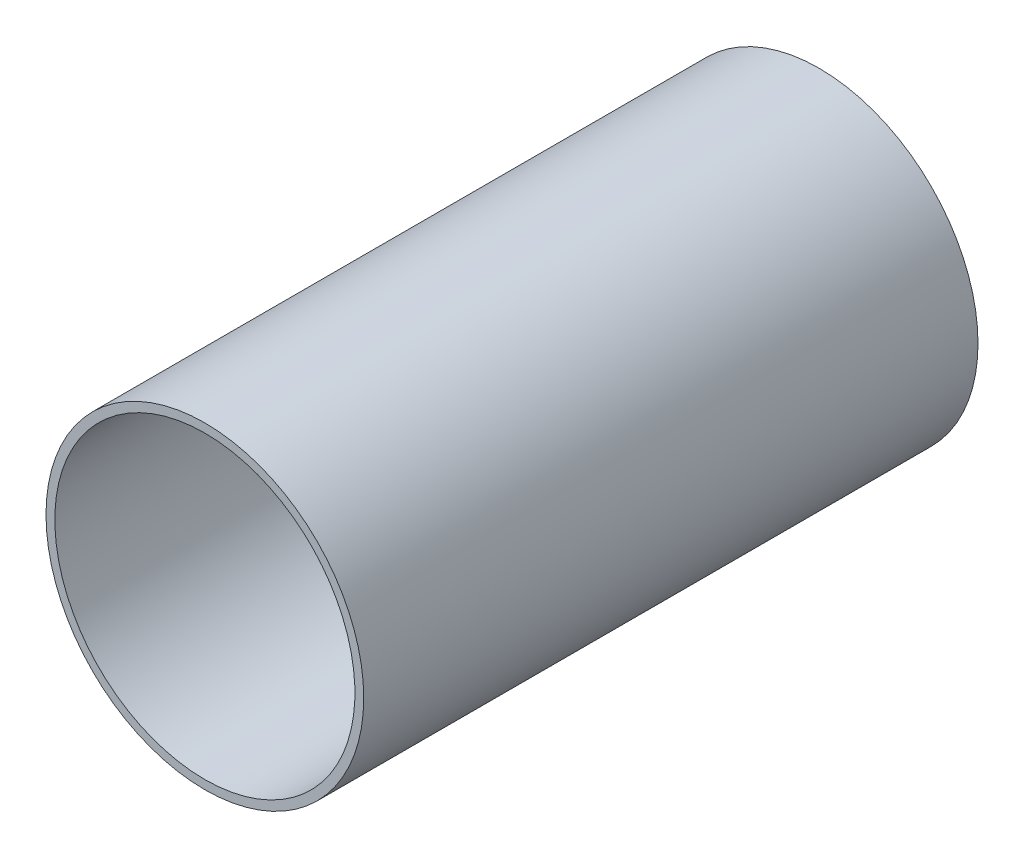
ISO-10303-21;
HEADER;
FILE_DESCRIPTION(('STEP AP214'),'2;1');
FILE_NAME('part.step','',(''),(''),'','','');
FILE_SCHEMA(('AUTOMOTIVE_DESIGN { 1 0 10303 214 1 1 1 1 }'));
ENDSEC;
DATA;
#1=APPLICATION_CONTEXT('core data for automotive mechanical design processes');
#2=APPLICATION_PROTOCOL_DEFINITION('international standard','automotive_design',2000,#1);
#3=PRODUCT_CONTEXT('',#1,'mechanical');
#4=PRODUCT('Part','Part','',(#3));
#5=PRODUCT_RELATED_PRODUCT_CATEGORY('part','',(#4));
#6=PRODUCT_DEFINITION_FORMATION('','',#4);
#7=PRODUCT_DEFINITION_CONTEXT('part definition',#1,'design');
#8=PRODUCT_DEFINITION('design','',#6,#7);
#9=PRODUCT_DEFINITION_SHAPE('','',#8);
#10=(LENGTH_UNIT() NAMED_UNIT(*) SI_UNIT(.MILLI.,.METRE.));
#11=(NAMED_UNIT(*) PLANE_ANGLE_UNIT() SI_UNIT($,.RADIAN.));
#12=(NAMED_UNIT(*) SI_UNIT($,.STERADIAN.) SOLID_ANGLE_UNIT());
#13=UNCERTAINTY_MEASURE_WITH_UNIT(LENGTH_MEASURE(1.E-05),#10,'distance_accuracy_value','');
#14=(GEOMETRIC_REPRESENTATION_CONTEXT(3) GLOBAL_UNCERTAINTY_ASSIGNED_CONTEXT((#13)) GLOBAL_UNIT_ASSIGNED_CONTEXT((#10,
#11,#12)) REPRESENTATION_CONTEXT('',''));
#15=CARTESIAN_POINT('',(0.,0.,0.));
#16=DIRECTION('',(0.,0.,1.));
#17=DIRECTION('',(1.,0.,0.));
#18=AXIS2_PLACEMENT_3D('',#15,#16,#17);
#19=CARTESIAN_POINT('',(169.418,-153.249,-0.045));
#20=DIRECTION('',(0.,0.,-1.));
#21=DIRECTION('',(0.,-1.,0.));
#22=AXIS2_PLACEMENT_3D('',#19,#20,#21);
#23=CYLINDRICAL_SURFACE('',#22,0.425);
#24=CARTESIAN_POINT('',(169.418,-153.249,-0.035));
#25=DIRECTION('',(0.,0.,-1.));
#26=DIRECTION('',(0.,-1.,0.));
#27=AXIS2_PLACEMENT_3D('',#24,#25,#26);
#28=CIRCLE('',#27,0.425);
#29=CARTESIAN_POINT('',(169.418,-153.674,-0.035));
#30=VERTEX_POINT('',#29);
#31=EDGE_CURVE('E63',#30,#30,#28,.T.);
#32=ORIENTED_EDGE('',*,*,#31,.T.);
#33=DIRECTION('',(0.,0.,1.));
#34=VECTOR('',#33,1.);
#35=CARTESIAN_POINT('',(169.418,-153.674,-0.045));
#36=LINE('',#35,#34);
#37=CARTESIAN_POINT('',(169.418,-153.674,1.705));
#38=VERTEX_POINT('',#37);
#39=EDGE_CURVE('E11',#30,#38,#36,.T.);
#40=ORIENTED_EDGE('',*,*,#39,.T.);
#41=CARTESIAN_POINT('',(169.418,-153.249,1.705));
#42=DIRECTION('',(0.,0.,-1.));
#43=DIRECTION('',(0.,-1.,0.));
#44=AXIS2_PLACEMENT_3D('',#41,#42,#43);
#45=CIRCLE('',#44,0.425);
#46=EDGE_CURVE('E25',#38,#38,#45,.T.);
#47=ORIENTED_EDGE('',*,*,#46,.F.);
#48=ORIENTED_EDGE('',*,*,#39,.F.);
#49=EDGE_LOOP('',(#32,#40,#47,#48));
#50=FACE_BOUND('',#49,.T.);
#51=ADVANCED_FACE('F17',(#50),#23,.F.);
#52=CARTESIAN_POINT('',(169.418,-153.699,1.705));
#53=DIRECTION('',(0.,0.,1.));
#54=DIRECTION('',(1.,0.,0.));
#55=AXIS2_PLACEMENT_3D('',#52,#53,#54);
#56=PLANE('',#55);
#57=ORIENTED_EDGE('',*,*,#46,.T.);
#58=EDGE_LOOP('',(#57));
#59=FACE_BOUND('',#58,.T.);
#60=CARTESIAN_POINT('',(169.418,-153.249,1.705));
#61=DIRECTION('',(0.,0.,1.));
#62=DIRECTION('',(0.,-1.,0.));
#63=AXIS2_PLACEMENT_3D('',#60,#61,#62);
#64=CIRCLE('',#63,0.45);
#65=CARTESIAN_POINT('',(169.418,-153.699,1.705));
#66=VERTEX_POINT('',#65);
#67=EDGE_CURVE('E55',#66,#66,#64,.T.);
#68=ORIENTED_EDGE('',*,*,#67,.T.);
#69=EDGE_LOOP('',(#68));
#70=FACE_BOUND('',#69,.T.);
#71=ADVANCED_FACE('F75',(#59,#70),#56,.T.);
#72=CARTESIAN_POINT('',(169.418,-153.699,-0.035));
#73=DIRECTION('',(0.,0.,1.));
#74=DIRECTION('',(1.,0.,0.));
#75=AXIS2_PLACEMENT_3D('',#72,#73,#74);
#76=PLANE('',#75);
#77=ORIENTED_EDGE('',*,*,#31,.F.);
#78=EDGE_LOOP('',(#77));
#79=FACE_BOUND('',#78,.T.);
#80=CARTESIAN_POINT('',(169.418,-153.249,-0.035));
#81=DIRECTION('',(0.,0.,1.));
#82=DIRECTION('',(0.,-1.,0.));
#83=AXIS2_PLACEMENT_3D('',#80,#81,#82);
#84=CIRCLE('',#83,0.45);
#85=CARTESIAN_POINT('',(169.418,-153.699,-0.035));
#86=VERTEX_POINT('',#85);
#87=EDGE_CURVE('E54',#86,#86,#84,.T.);
#88=ORIENTED_EDGE('',*,*,#87,.F.);
#89=EDGE_LOOP('',(#88));
#90=FACE_BOUND('',#89,.T.);
#91=ADVANCED_FACE('F83',(#79,#90),#76,.F.);
#92=CARTESIAN_POINT('',(169.418,-153.249,-0.035));
#93=DIRECTION('',(0.,0.,-1.));
#94=DIRECTION('',(0.,-1.,0.));
#95=AXIS2_PLACEMENT_3D('',#92,#93,#94);
#96=CYLINDRICAL_SURFACE('',#95,0.45);
#97=ORIENTED_EDGE('',*,*,#87,.T.);
#98=DIRECTION('',(0.,0.,1.));
#99=VECTOR('',#98,1.);
#100=CARTESIAN_POINT('',(169.418,-153.699,-0.035));
#101=LINE('',#100,#99);
#102=EDGE_CURVE('E51',#86,#66,#101,.T.);
#103=ORIENTED_EDGE('',*,*,#102,.T.);
#104=ORIENTED_EDGE('',*,*,#67,.F.);
#105=ORIENTED_EDGE('',*,*,#102,.F.);
#106=EDGE_LOOP('',(#97,#103,#104,#105));
#107=FACE_BOUND('',#106,.T.);
#108=ADVANCED_FACE('F52',(#107),#96,.T.);
#109=CLOSED_SHELL('',(#51,#71,#91,#108));
#110=MANIFOLD_SOLID_BREP('B1',#109);
#111=ADVANCED_BREP_SHAPE_REPRESENTATION('',(#18,#110),#14);
#112=SHAPE_DEFINITION_REPRESENTATION(#9,#111);
ENDSEC;
END-ISO-10303-21;
